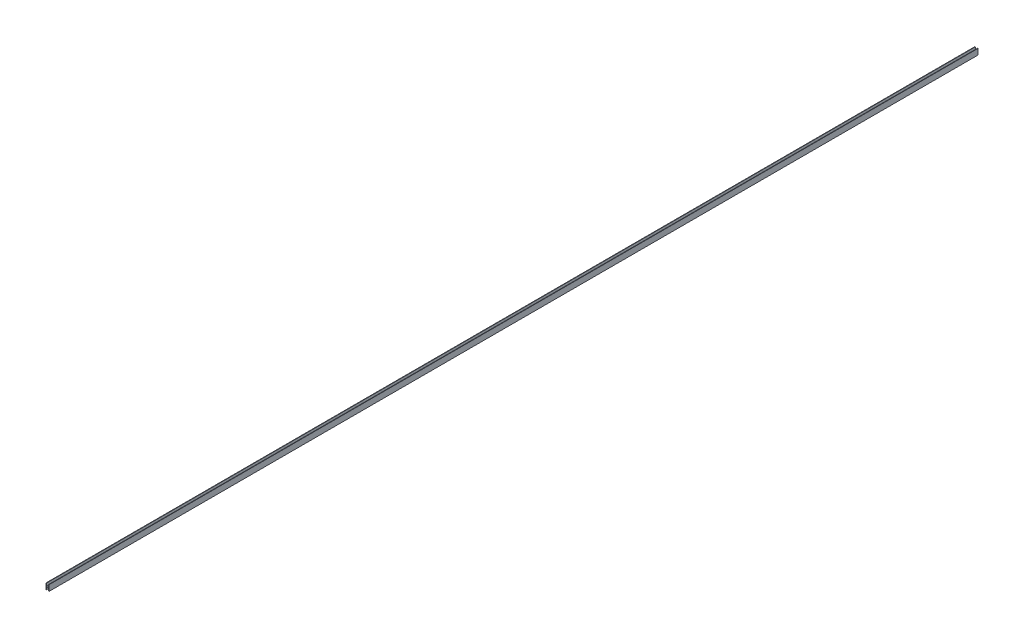
ISO-10303-21;
HEADER;
FILE_DESCRIPTION(('STEP AP214'),'2;1');
FILE_NAME('part.step','',(''),(''),'','','');
FILE_SCHEMA(('AUTOMOTIVE_DESIGN { 1 0 10303 214 1 1 1 1 }'));
ENDSEC;
DATA;
#1=APPLICATION_CONTEXT('core data for automotive mechanical design processes');
#2=APPLICATION_PROTOCOL_DEFINITION('international standard','automotive_design',2000,#1);
#3=PRODUCT_CONTEXT('',#1,'mechanical');
#4=PRODUCT('Part','Part','',(#3));
#5=PRODUCT_RELATED_PRODUCT_CATEGORY('part','',(#4));
#6=PRODUCT_DEFINITION_FORMATION('','',#4);
#7=PRODUCT_DEFINITION_CONTEXT('part definition',#1,'design');
#8=PRODUCT_DEFINITION('design','',#6,#7);
#9=PRODUCT_DEFINITION_SHAPE('','',#8);
#10=(LENGTH_UNIT() NAMED_UNIT(*) SI_UNIT(.MILLI.,.METRE.));
#11=(NAMED_UNIT(*) PLANE_ANGLE_UNIT() SI_UNIT($,.RADIAN.));
#12=(NAMED_UNIT(*) SI_UNIT($,.STERADIAN.) SOLID_ANGLE_UNIT());
#13=UNCERTAINTY_MEASURE_WITH_UNIT(LENGTH_MEASURE(1.E-05),#10,'distance_accuracy_value','');
#14=(GEOMETRIC_REPRESENTATION_CONTEXT(3) GLOBAL_UNCERTAINTY_ASSIGNED_CONTEXT((#13)) GLOBAL_UNIT_ASSIGNED_CONTEXT((#10,
#11,#12)) REPRESENTATION_CONTEXT('',''));
#15=CARTESIAN_POINT('',(0.,0.,0.));
#16=DIRECTION('',(0.,0.,1.));
#17=DIRECTION('',(1.,0.,0.));
#18=AXIS2_PLACEMENT_3D('',#15,#16,#17);
#19=CARTESIAN_POINT('',(-4.,7.5,2400.));
#20=DIRECTION('',(0.,-1.,0.));
#21=DIRECTION('',(0.,0.,-1.));
#22=AXIS2_PLACEMENT_3D('',#19,#20,#21);
#23=PLANE('',#22);
#24=DIRECTION('',(-1.,0.,0.));
#25=VECTOR('',#24,1.);
#26=CARTESIAN_POINT('',(-4.,7.5,2400.));
#27=LINE('',#26,#25);
#28=CARTESIAN_POINT('',(-3.,7.5,2400.));
#29=VERTEX_POINT('',#28);
#30=CARTESIAN_POINT('',(-4.,7.5,2400.));
#31=VERTEX_POINT('',#30);
#32=EDGE_CURVE('E206',#29,#31,#27,.T.);
#33=ORIENTED_EDGE('',*,*,#32,.F.);
#34=DIRECTION('',(0.,0.,-1.));
#35=VECTOR('',#34,1.);
#36=CARTESIAN_POINT('',(-3.,7.5,2400.));
#37=LINE('',#36,#35);
#38=CARTESIAN_POINT('',(-3.,7.5,0.));
#39=VERTEX_POINT('',#38);
#40=EDGE_CURVE('E190',#29,#39,#37,.T.);
#41=ORIENTED_EDGE('',*,*,#40,.T.);
#42=DIRECTION('',(-1.,0.,0.));
#43=VECTOR('',#42,1.);
#44=CARTESIAN_POINT('',(-4.,7.5,0.));
#45=LINE('',#44,#43);
#46=CARTESIAN_POINT('',(-4.,7.5,0.));
#47=VERTEX_POINT('',#46);
#48=EDGE_CURVE('E222',#39,#47,#45,.T.);
#49=ORIENTED_EDGE('',*,*,#48,.T.);
#50=DIRECTION('',(0.,0.,-1.));
#51=VECTOR('',#50,1.);
#52=CARTESIAN_POINT('',(-4.,7.5,2400.));
#53=LINE('',#52,#51);
#54=EDGE_CURVE('E241',#31,#47,#53,.T.);
#55=ORIENTED_EDGE('',*,*,#54,.F.);
#56=EDGE_LOOP('',(#33,#41,#49,#55));
#57=FACE_BOUND('',#56,.T.);
#58=ADVANCED_FACE('F39',(#57),#23,.F.);
#59=CARTESIAN_POINT('',(-4.,-7.5,2400.));
#60=DIRECTION('',(0.,1.,0.));
#61=DIRECTION('',(0.,0.,1.));
#62=AXIS2_PLACEMENT_3D('',#59,#60,#61);
#63=PLANE('',#62);
#64=DIRECTION('',(1.,0.,0.));
#65=VECTOR('',#64,1.);
#66=CARTESIAN_POINT('',(-4.,-7.5,0.));
#67=LINE('',#66,#65);
#68=CARTESIAN_POINT('',(-4.,-7.5,0.));
#69=VERTEX_POINT('',#68);
#70=CARTESIAN_POINT('',(-3.,-7.5,0.));
#71=VERTEX_POINT('',#70);
#72=EDGE_CURVE('E207',#69,#71,#67,.T.);
#73=ORIENTED_EDGE('',*,*,#72,.T.);
#74=DIRECTION('',(0.,0.,1.));
#75=VECTOR('',#74,1.);
#76=CARTESIAN_POINT('',(-3.,-7.5,2400.));
#77=LINE('',#76,#75);
#78=CARTESIAN_POINT('',(-3.,-7.5,2400.));
#79=VERTEX_POINT('',#78);
#80=EDGE_CURVE('E198',#71,#79,#77,.T.);
#81=ORIENTED_EDGE('',*,*,#80,.T.);
#82=DIRECTION('',(1.,0.,0.));
#83=VECTOR('',#82,1.);
#84=CARTESIAN_POINT('',(-4.,-7.5,2400.));
#85=LINE('',#84,#83);
#86=CARTESIAN_POINT('',(-4.,-7.5,2400.));
#87=VERTEX_POINT('',#86);
#88=EDGE_CURVE('E148',#87,#79,#85,.T.);
#89=ORIENTED_EDGE('',*,*,#88,.F.);
#90=DIRECTION('',(0.,0.,-1.));
#91=VECTOR('',#90,1.);
#92=CARTESIAN_POINT('',(-4.,-7.5,2400.));
#93=LINE('',#92,#91);
#94=EDGE_CURVE('E237',#87,#69,#93,.T.);
#95=ORIENTED_EDGE('',*,*,#94,.T.);
#96=EDGE_LOOP('',(#73,#81,#89,#95));
#97=FACE_BOUND('',#96,.T.);
#98=ADVANCED_FACE('F286',(#97),#63,.F.);
#99=CARTESIAN_POINT('',(4.,-7.5,2400.));
#100=DIRECTION('',(-1.,0.,0.));
#101=DIRECTION('',(0.,0.,1.));
#102=AXIS2_PLACEMENT_3D('',#99,#100,#101);
#103=PLANE('',#102);
#104=DIRECTION('',(0.,1.,0.));
#105=VECTOR('',#104,1.);
#106=CARTESIAN_POINT('',(4.,-7.5,0.));
#107=LINE('',#106,#105);
#108=CARTESIAN_POINT('',(4.,-7.5,0.));
#109=VERTEX_POINT('',#108);
#110=CARTESIAN_POINT('',(4.,7.5,0.));
#111=VERTEX_POINT('',#110);
#112=EDGE_CURVE('E201',#109,#111,#107,.T.);
#113=ORIENTED_EDGE('',*,*,#112,.T.);
#114=DIRECTION('',(0.,0.,-1.));
#115=VECTOR('',#114,1.);
#116=CARTESIAN_POINT('',(4.,7.5,2400.));
#117=LINE('',#116,#115);
#118=CARTESIAN_POINT('',(4.,7.5,2400.));
#119=VERTEX_POINT('',#118);
#120=EDGE_CURVE('E245',#119,#111,#117,.T.);
#121=ORIENTED_EDGE('',*,*,#120,.F.);
#122=DIRECTION('',(0.,1.,0.));
#123=VECTOR('',#122,1.);
#124=CARTESIAN_POINT('',(4.,-7.5,2400.));
#125=LINE('',#124,#123);
#126=CARTESIAN_POINT('',(4.,-7.5,2400.));
#127=VERTEX_POINT('',#126);
#128=EDGE_CURVE('E202',#127,#119,#125,.T.);
#129=ORIENTED_EDGE('',*,*,#128,.F.);
#130=DIRECTION('',(0.,0.,-1.));
#131=VECTOR('',#130,1.);
#132=CARTESIAN_POINT('',(4.,-7.5,2400.));
#133=LINE('',#132,#131);
#134=EDGE_CURVE('E218',#127,#109,#133,.T.);
#135=ORIENTED_EDGE('',*,*,#134,.T.);
#136=EDGE_LOOP('',(#113,#121,#129,#135));
#137=FACE_BOUND('',#136,.T.);
#138=ADVANCED_FACE('F41',(#137),#103,.F.);
#139=CARTESIAN_POINT('',(3.,7.5,0.));
#140=VERTEX_POINT('',#139);
#141=EDGE_CURVE('E223',#111,#140,#45,.T.);
#142=ORIENTED_EDGE('',*,*,#141,.T.);
#143=DIRECTION('',(0.,0.,1.));
#144=VECTOR('',#143,1.);
#145=CARTESIAN_POINT('',(3.,7.5,2400.));
#146=LINE('',#145,#144);
#147=CARTESIAN_POINT('',(3.,7.5,2400.));
#148=VERTEX_POINT('',#147);
#149=EDGE_CURVE('E62',#140,#148,#146,.T.);
#150=ORIENTED_EDGE('',*,*,#149,.T.);
#151=EDGE_CURVE('E208',#119,#148,#27,.T.);
#152=ORIENTED_EDGE('',*,*,#151,.F.);
#153=ORIENTED_EDGE('',*,*,#120,.T.);
#154=EDGE_LOOP('',(#142,#150,#152,#153));
#155=FACE_BOUND('',#154,.T.);
#156=ADVANCED_FACE('F280',(#155),#23,.F.);
#157=CARTESIAN_POINT('',(-4.,-7.5,2400.));
#158=DIRECTION('',(1.,0.,0.));
#159=DIRECTION('',(0.,0.,-1.));
#160=AXIS2_PLACEMENT_3D('',#157,#158,#159);
#161=PLANE('',#160);
#162=DIRECTION('',(0.,-1.,0.));
#163=VECTOR('',#162,1.);
#164=CARTESIAN_POINT('',(-4.,-7.5,0.));
#165=LINE('',#164,#163);
#166=EDGE_CURVE('E227',#47,#69,#165,.T.);
#167=ORIENTED_EDGE('',*,*,#166,.T.);
#168=ORIENTED_EDGE('',*,*,#94,.F.);
#169=DIRECTION('',(0.,-1.,0.));
#170=VECTOR('',#169,1.);
#171=CARTESIAN_POINT('',(-4.,-7.5,2400.));
#172=LINE('',#171,#170);
#173=EDGE_CURVE('E212',#31,#87,#172,.T.);
#174=ORIENTED_EDGE('',*,*,#173,.F.);
#175=ORIENTED_EDGE('',*,*,#54,.T.);
#176=EDGE_LOOP('',(#167,#168,#174,#175));
#177=FACE_BOUND('',#176,.T.);
#178=ADVANCED_FACE('F289',(#177),#161,.F.);
#179=CARTESIAN_POINT('',(3.,-7.5,2400.));
#180=VERTEX_POINT('',#179);
#181=EDGE_CURVE('E215',#180,#127,#85,.T.);
#182=ORIENTED_EDGE('',*,*,#181,.F.);
#183=DIRECTION('',(0.,0.,-1.));
#184=VECTOR('',#183,1.);
#185=CARTESIAN_POINT('',(3.,-7.5,2400.));
#186=LINE('',#185,#184);
#187=CARTESIAN_POINT('',(3.,-7.5,0.));
#188=VERTEX_POINT('',#187);
#189=EDGE_CURVE('E194',#180,#188,#186,.T.);
#190=ORIENTED_EDGE('',*,*,#189,.T.);
#191=EDGE_CURVE('E230',#188,#109,#67,.T.);
#192=ORIENTED_EDGE('',*,*,#191,.T.);
#193=ORIENTED_EDGE('',*,*,#134,.F.);
#194=EDGE_LOOP('',(#182,#190,#192,#193));
#195=FACE_BOUND('',#194,.T.);
#196=ADVANCED_FACE('F273',(#195),#63,.F.);
#197=CARTESIAN_POINT('',(0.,0.,2400.));
#198=DIRECTION('',(0.,0.,-1.));
#199=DIRECTION('',(-1.,0.,0.));
#200=AXIS2_PLACEMENT_3D('',#197,#198,#199);
#201=PLANE('',#200);
#202=ORIENTED_EDGE('',*,*,#88,.T.);
#203=DIRECTION('',(0.,1.,0.));
#204=VECTOR('',#203,1.);
#205=CARTESIAN_POINT('',(-3.,-14.5,2400.));
#206=LINE('',#205,#204);
#207=CARTESIAN_POINT('',(-3.,-0.5,2400.));
#208=VERTEX_POINT('',#207);
#209=EDGE_CURVE('E129',#79,#208,#206,.T.);
#210=ORIENTED_EDGE('',*,*,#209,.T.);
#211=DIRECTION('',(1.,0.,0.));
#212=VECTOR('',#211,1.);
#213=CARTESIAN_POINT('',(3.,-0.5,2400.));
#214=LINE('',#213,#212);
#215=CARTESIAN_POINT('',(3.,-0.5,2400.));
#216=VERTEX_POINT('',#215);
#217=EDGE_CURVE('E138',#208,#216,#214,.T.);
#218=ORIENTED_EDGE('',*,*,#217,.T.);
#219=DIRECTION('',(0.,-1.,0.));
#220=VECTOR('',#219,1.);
#221=CARTESIAN_POINT('',(3.,-14.5,2400.));
#222=LINE('',#221,#220);
#223=EDGE_CURVE('E135',#216,#180,#222,.T.);
#224=ORIENTED_EDGE('',*,*,#223,.T.);
#225=ORIENTED_EDGE('',*,*,#181,.T.);
#226=ORIENTED_EDGE('',*,*,#128,.T.);
#227=ORIENTED_EDGE('',*,*,#151,.T.);
#228=DIRECTION('',(0.,-1.,0.));
#229=VECTOR('',#228,1.);
#230=CARTESIAN_POINT('',(3.,0.5,2400.));
#231=LINE('',#230,#229);
#232=CARTESIAN_POINT('',(3.,0.5,2400.));
#233=VERTEX_POINT('',#232);
#234=EDGE_CURVE('E167',#148,#233,#231,.T.);
#235=ORIENTED_EDGE('',*,*,#234,.T.);
#236=DIRECTION('',(-1.,0.,0.));
#237=VECTOR('',#236,1.);
#238=CARTESIAN_POINT('',(3.,0.5,2400.));
#239=LINE('',#238,#237);
#240=CARTESIAN_POINT('',(-3.,0.5,2400.));
#241=VERTEX_POINT('',#240);
#242=EDGE_CURVE('E172',#233,#241,#239,.T.);
#243=ORIENTED_EDGE('',*,*,#242,.T.);
#244=DIRECTION('',(0.,1.,0.));
#245=VECTOR('',#244,1.);
#246=CARTESIAN_POINT('',(-3.,0.5,2400.));
#247=LINE('',#246,#245);
#248=EDGE_CURVE('E163',#241,#29,#247,.T.);
#249=ORIENTED_EDGE('',*,*,#248,.T.);
#250=ORIENTED_EDGE('',*,*,#32,.T.);
#251=ORIENTED_EDGE('',*,*,#173,.T.);
#252=EDGE_LOOP('',(#202,#210,#218,#224,#225,#226,#227,#235,#243,#249,#250,#251));
#253=FACE_BOUND('',#252,.T.);
#254=ADVANCED_FACE('F146',(#253),#201,.F.);
#255=CARTESIAN_POINT('',(0.,0.,0.));
#256=DIRECTION('',(0.,0.,-1.));
#257=DIRECTION('',(-1.,0.,0.));
#258=AXIS2_PLACEMENT_3D('',#255,#256,#257);
#259=PLANE('',#258);
#260=DIRECTION('',(0.,1.,0.));
#261=VECTOR('',#260,1.);
#262=CARTESIAN_POINT('',(-3.,0.,0.));
#263=LINE('',#262,#261);
#264=CARTESIAN_POINT('',(-3.,-0.5,0.));
#265=VERTEX_POINT('',#264);
#266=EDGE_CURVE('E11',#71,#265,#263,.T.);
#267=ORIENTED_EDGE('',*,*,#266,.F.);
#268=ORIENTED_EDGE('',*,*,#72,.F.);
#269=ORIENTED_EDGE('',*,*,#166,.F.);
#270=ORIENTED_EDGE('',*,*,#48,.F.);
#271=DIRECTION('',(0.,1.,0.));
#272=VECTOR('',#271,1.);
#273=CARTESIAN_POINT('',(-3.,0.5,0.));
#274=LINE('',#273,#272);
#275=CARTESIAN_POINT('',(-3.,0.5,0.));
#276=VERTEX_POINT('',#275);
#277=EDGE_CURVE('E177',#276,#39,#274,.T.);
#278=ORIENTED_EDGE('',*,*,#277,.F.);
#279=DIRECTION('',(-1.,0.,0.));
#280=VECTOR('',#279,1.);
#281=CARTESIAN_POINT('',(3.,0.5,0.));
#282=LINE('',#281,#280);
#283=CARTESIAN_POINT('',(3.,0.5,0.));
#284=VERTEX_POINT('',#283);
#285=EDGE_CURVE('E168',#284,#276,#282,.T.);
#286=ORIENTED_EDGE('',*,*,#285,.F.);
#287=DIRECTION('',(0.,-1.,0.));
#288=VECTOR('',#287,1.);
#289=CARTESIAN_POINT('',(3.,0.,0.));
#290=LINE('',#289,#288);
#291=EDGE_CURVE('E48',#140,#284,#290,.T.);
#292=ORIENTED_EDGE('',*,*,#291,.F.);
#293=ORIENTED_EDGE('',*,*,#141,.F.);
#294=ORIENTED_EDGE('',*,*,#112,.F.);
#295=ORIENTED_EDGE('',*,*,#191,.F.);
#296=DIRECTION('',(0.,-1.,0.));
#297=VECTOR('',#296,1.);
#298=CARTESIAN_POINT('',(3.,-14.5,0.));
#299=LINE('',#298,#297);
#300=CARTESIAN_POINT('',(3.,-0.5,0.));
#301=VERTEX_POINT('',#300);
#302=EDGE_CURVE('E150',#301,#188,#299,.T.);
#303=ORIENTED_EDGE('',*,*,#302,.F.);
#304=DIRECTION('',(1.,0.,0.));
#305=VECTOR('',#304,1.);
#306=CARTESIAN_POINT('',(3.,-0.5,0.));
#307=LINE('',#306,#305);
#308=EDGE_CURVE('E153',#265,#301,#307,.T.);
#309=ORIENTED_EDGE('',*,*,#308,.F.);
#310=EDGE_LOOP('',(#267,#268,#269,#270,#278,#286,#292,#293,#294,#295,#303,#309));
#311=FACE_BOUND('',#310,.T.);
#312=ADVANCED_FACE('F256',(#311),#259,.T.);
#313=CARTESIAN_POINT('',(-3.,0.5,2400.));
#314=DIRECTION('',(-1.,0.,0.));
#315=DIRECTION('',(0.,0.,1.));
#316=AXIS2_PLACEMENT_3D('',#313,#314,#315);
#317=PLANE('',#316);
#318=ORIENTED_EDGE('',*,*,#248,.F.);
#319=DIRECTION('',(0.,0.,-1.));
#320=VECTOR('',#319,1.);
#321=CARTESIAN_POINT('',(-3.,0.5,2400.));
#322=LINE('',#321,#320);
#323=EDGE_CURVE('E159',#241,#276,#322,.T.);
#324=ORIENTED_EDGE('',*,*,#323,.T.);
#325=ORIENTED_EDGE('',*,*,#277,.T.);
#326=ORIENTED_EDGE('',*,*,#40,.F.);
#327=EDGE_LOOP('',(#318,#324,#325,#326));
#328=FACE_BOUND('',#327,.T.);
#329=ADVANCED_FACE('F261',(#328),#317,.F.);
#330=CARTESIAN_POINT('',(3.,0.5,2400.));
#331=DIRECTION('',(1.,0.,0.));
#332=DIRECTION('',(0.,0.,-1.));
#333=AXIS2_PLACEMENT_3D('',#330,#331,#332);
#334=PLANE('',#333);
#335=ORIENTED_EDGE('',*,*,#291,.T.);
#336=DIRECTION('',(0.,0.,-1.));
#337=VECTOR('',#336,1.);
#338=CARTESIAN_POINT('',(3.,0.5,2400.));
#339=LINE('',#338,#337);
#340=EDGE_CURVE('E176',#233,#284,#339,.T.);
#341=ORIENTED_EDGE('',*,*,#340,.F.);
#342=ORIENTED_EDGE('',*,*,#234,.F.);
#343=ORIENTED_EDGE('',*,*,#149,.F.);
#344=EDGE_LOOP('',(#335,#341,#342,#343));
#345=FACE_BOUND('',#344,.T.);
#346=ADVANCED_FACE('F249',(#345),#334,.F.);
#347=CARTESIAN_POINT('',(3.,0.5,2400.));
#348=DIRECTION('',(0.,-1.,0.));
#349=DIRECTION('',(0.,0.,-1.));
#350=AXIS2_PLACEMENT_3D('',#347,#348,#349);
#351=PLANE('',#350);
#352=ORIENTED_EDGE('',*,*,#285,.T.);
#353=ORIENTED_EDGE('',*,*,#323,.F.);
#354=ORIENTED_EDGE('',*,*,#242,.F.);
#355=ORIENTED_EDGE('',*,*,#340,.T.);
#356=EDGE_LOOP('',(#352,#353,#354,#355));
#357=FACE_BOUND('',#356,.T.);
#358=ADVANCED_FACE('F254',(#357),#351,.F.);
#359=CARTESIAN_POINT('',(-3.,-14.5,2400.));
#360=DIRECTION('',(-1.,0.,0.));
#361=DIRECTION('',(0.,0.,1.));
#362=AXIS2_PLACEMENT_3D('',#359,#360,#361);
#363=PLANE('',#362);
#364=ORIENTED_EDGE('',*,*,#266,.T.);
#365=DIRECTION('',(0.,0.,-1.));
#366=VECTOR('',#365,1.);
#367=CARTESIAN_POINT('',(-3.,-0.5,2400.));
#368=LINE('',#367,#366);
#369=EDGE_CURVE('E55',#208,#265,#368,.T.);
#370=ORIENTED_EDGE('',*,*,#369,.F.);
#371=ORIENTED_EDGE('',*,*,#209,.F.);
#372=ORIENTED_EDGE('',*,*,#80,.F.);
#373=EDGE_LOOP('',(#364,#370,#371,#372));
#374=FACE_BOUND('',#373,.T.);
#375=ADVANCED_FACE('F127',(#374),#363,.F.);
#376=CARTESIAN_POINT('',(3.,-14.5,2400.));
#377=DIRECTION('',(1.,0.,0.));
#378=DIRECTION('',(0.,0.,-1.));
#379=AXIS2_PLACEMENT_3D('',#376,#377,#378);
#380=PLANE('',#379);
#381=ORIENTED_EDGE('',*,*,#223,.F.);
#382=DIRECTION('',(0.,0.,-1.));
#383=VECTOR('',#382,1.);
#384=CARTESIAN_POINT('',(3.,-0.5,2400.));
#385=LINE('',#384,#383);
#386=EDGE_CURVE('E134',#216,#301,#385,.T.);
#387=ORIENTED_EDGE('',*,*,#386,.T.);
#388=ORIENTED_EDGE('',*,*,#302,.T.);
#389=ORIENTED_EDGE('',*,*,#189,.F.);
#390=EDGE_LOOP('',(#381,#387,#388,#389));
#391=FACE_BOUND('',#390,.T.);
#392=ADVANCED_FACE('F283',(#391),#380,.F.);
#393=CARTESIAN_POINT('',(3.,-0.5,2400.));
#394=DIRECTION('',(0.,1.,0.));
#395=DIRECTION('',(0.,0.,1.));
#396=AXIS2_PLACEMENT_3D('',#393,#394,#395);
#397=PLANE('',#396);
#398=ORIENTED_EDGE('',*,*,#308,.T.);
#399=ORIENTED_EDGE('',*,*,#386,.F.);
#400=ORIENTED_EDGE('',*,*,#217,.F.);
#401=ORIENTED_EDGE('',*,*,#369,.T.);
#402=EDGE_LOOP('',(#398,#399,#400,#401));
#403=FACE_BOUND('',#402,.T.);
#404=ADVANCED_FACE('F139',(#403),#397,.F.);
#405=CLOSED_SHELL('',(#58,#98,#138,#156,#178,#196,#254,#312,#329,#346,#358,#375,#392,#404));
#406=MANIFOLD_SOLID_BREP('B2',#405);
#407=ADVANCED_BREP_SHAPE_REPRESENTATION('',(#18,#406),#14);
#408=SHAPE_DEFINITION_REPRESENTATION(#9,#407);
ENDSEC;
END-ISO-10303-21;
